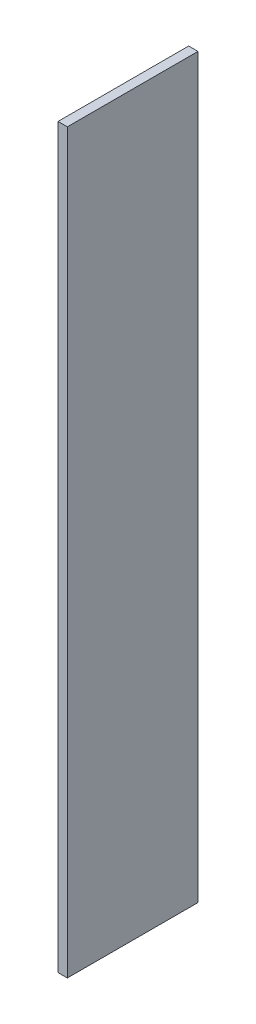
ISO-10303-21;
HEADER;
FILE_DESCRIPTION(('STEP AP214'),'2;1');
FILE_NAME('part.step','',(''),(''),'','','');
FILE_SCHEMA(('AUTOMOTIVE_DESIGN { 1 0 10303 214 1 1 1 1 }'));
ENDSEC;
DATA;
#1=APPLICATION_CONTEXT('core data for automotive mechanical design processes');
#2=APPLICATION_PROTOCOL_DEFINITION('international standard','automotive_design',2000,#1);
#3=PRODUCT_CONTEXT('',#1,'mechanical');
#4=PRODUCT('Part','Part','',(#3));
#5=PRODUCT_RELATED_PRODUCT_CATEGORY('part','',(#4));
#6=PRODUCT_DEFINITION_FORMATION('','',#4);
#7=PRODUCT_DEFINITION_CONTEXT('part definition',#1,'design');
#8=PRODUCT_DEFINITION('design','',#6,#7);
#9=PRODUCT_DEFINITION_SHAPE('','',#8);
#10=(LENGTH_UNIT() NAMED_UNIT(*) SI_UNIT(.MILLI.,.METRE.));
#11=(NAMED_UNIT(*) PLANE_ANGLE_UNIT() SI_UNIT($,.RADIAN.));
#12=(NAMED_UNIT(*) SI_UNIT($,.STERADIAN.) SOLID_ANGLE_UNIT());
#13=UNCERTAINTY_MEASURE_WITH_UNIT(LENGTH_MEASURE(1.E-05),#10,'distance_accuracy_value','');
#14=(GEOMETRIC_REPRESENTATION_CONTEXT(3) GLOBAL_UNCERTAINTY_ASSIGNED_CONTEXT((#13)) GLOBAL_UNIT_ASSIGNED_CONTEXT((#10,
#11,#12)) REPRESENTATION_CONTEXT('',''));
#15=CARTESIAN_POINT('',(0.,0.,0.));
#16=DIRECTION('',(0.,0.,1.));
#17=DIRECTION('',(1.,0.,0.));
#18=AXIS2_PLACEMENT_3D('',#15,#16,#17);
#19=CARTESIAN_POINT('',(6.35,0.,0.));
#20=DIRECTION('',(0.,0.,-1.));
#21=DIRECTION('',(-1.,0.,0.));
#22=AXIS2_PLACEMENT_3D('',#19,#20,#21);
#23=PLANE('',#22);
#24=DIRECTION('',(0.,-1.,0.));
#25=VECTOR('',#24,1.);
#26=CARTESIAN_POINT('',(0.,0.,0.));
#27=LINE('',#26,#25);
#28=CARTESIAN_POINT('',(0.,501.65,0.));
#29=VERTEX_POINT('',#28);
#30=CARTESIAN_POINT('',(0.,0.,0.));
#31=VERTEX_POINT('',#30);
#32=EDGE_CURVE('E95',#29,#31,#27,.T.);
#33=ORIENTED_EDGE('',*,*,#32,.T.);
#34=DIRECTION('',(-1.,0.,0.));
#35=VECTOR('',#34,1.);
#36=CARTESIAN_POINT('',(6.35,0.,0.));
#37=LINE('',#36,#35);
#38=CARTESIAN_POINT('',(6.35,0.,0.));
#39=VERTEX_POINT('',#38);
#40=EDGE_CURVE('E11',#39,#31,#37,.T.);
#41=ORIENTED_EDGE('',*,*,#40,.F.);
#42=DIRECTION('',(0.,-1.,0.));
#43=VECTOR('',#42,1.);
#44=CARTESIAN_POINT('',(6.35,0.,0.));
#45=LINE('',#44,#43);
#46=CARTESIAN_POINT('',(6.35,501.65,0.));
#47=VERTEX_POINT('',#46);
#48=EDGE_CURVE('E83',#47,#39,#45,.T.);
#49=ORIENTED_EDGE('',*,*,#48,.F.);
#50=DIRECTION('',(-1.,0.,0.));
#51=VECTOR('',#50,1.);
#52=CARTESIAN_POINT('',(6.35,501.65,0.));
#53=LINE('',#52,#51);
#54=EDGE_CURVE('E91',#47,#29,#53,.T.);
#55=ORIENTED_EDGE('',*,*,#54,.T.);
#56=EDGE_LOOP('',(#33,#41,#49,#55));
#57=FACE_BOUND('',#56,.T.);
#58=ADVANCED_FACE('F32',(#57),#23,.F.);
#59=CARTESIAN_POINT('',(6.35,0.,0.));
#60=DIRECTION('',(0.,1.,0.));
#61=DIRECTION('',(0.,0.,1.));
#62=AXIS2_PLACEMENT_3D('',#59,#60,#61);
#63=PLANE('',#62);
#64=DIRECTION('',(0.,0.,-1.));
#65=VECTOR('',#64,1.);
#66=CARTESIAN_POINT('',(0.,0.,0.));
#67=LINE('',#66,#65);
#68=CARTESIAN_POINT('',(0.,0.,-88.9));
#69=VERTEX_POINT('',#68);
#70=EDGE_CURVE('E87',#31,#69,#67,.T.);
#71=ORIENTED_EDGE('',*,*,#70,.T.);
#72=DIRECTION('',(-1.,0.,0.));
#73=VECTOR('',#72,1.);
#74=CARTESIAN_POINT('',(6.35,0.,-88.9));
#75=LINE('',#74,#73);
#76=CARTESIAN_POINT('',(6.35,0.,-88.9));
#77=VERTEX_POINT('',#76);
#78=EDGE_CURVE('E40',#77,#69,#75,.T.);
#79=ORIENTED_EDGE('',*,*,#78,.F.);
#80=DIRECTION('',(0.,0.,-1.));
#81=VECTOR('',#80,1.);
#82=CARTESIAN_POINT('',(6.35,0.,0.));
#83=LINE('',#82,#81);
#84=EDGE_CURVE('E78',#39,#77,#83,.T.);
#85=ORIENTED_EDGE('',*,*,#84,.F.);
#86=ORIENTED_EDGE('',*,*,#40,.T.);
#87=EDGE_LOOP('',(#71,#79,#85,#86));
#88=FACE_BOUND('',#87,.T.);
#89=ADVANCED_FACE('F86',(#88),#63,.F.);
#90=CARTESIAN_POINT('',(6.35,0.,-88.9));
#91=DIRECTION('',(0.,0.,1.));
#92=DIRECTION('',(1.,0.,0.));
#93=AXIS2_PLACEMENT_3D('',#90,#91,#92);
#94=PLANE('',#93);
#95=DIRECTION('',(0.,1.,0.));
#96=VECTOR('',#95,1.);
#97=CARTESIAN_POINT('',(0.,0.,-88.9));
#98=LINE('',#97,#96);
#99=CARTESIAN_POINT('',(0.,501.65,-88.9));
#100=VERTEX_POINT('',#99);
#101=EDGE_CURVE('E65',#69,#100,#98,.T.);
#102=ORIENTED_EDGE('',*,*,#101,.T.);
#103=DIRECTION('',(-1.,0.,0.));
#104=VECTOR('',#103,1.);
#105=CARTESIAN_POINT('',(6.35,501.65,-88.9));
#106=LINE('',#105,#104);
#107=CARTESIAN_POINT('',(6.35,501.65,-88.9));
#108=VERTEX_POINT('',#107);
#109=EDGE_CURVE('E88',#108,#100,#106,.T.);
#110=ORIENTED_EDGE('',*,*,#109,.F.);
#111=DIRECTION('',(0.,1.,0.));
#112=VECTOR('',#111,1.);
#113=CARTESIAN_POINT('',(6.35,0.,-88.9));
#114=LINE('',#113,#112);
#115=EDGE_CURVE('E81',#77,#108,#114,.T.);
#116=ORIENTED_EDGE('',*,*,#115,.F.);
#117=ORIENTED_EDGE('',*,*,#78,.T.);
#118=EDGE_LOOP('',(#102,#110,#116,#117));
#119=FACE_BOUND('',#118,.T.);
#120=ADVANCED_FACE('F89',(#119),#94,.F.);
#121=CARTESIAN_POINT('',(6.35,501.65,0.));
#122=DIRECTION('',(0.,-1.,0.));
#123=DIRECTION('',(0.,0.,-1.));
#124=AXIS2_PLACEMENT_3D('',#121,#122,#123);
#125=PLANE('',#124);
#126=DIRECTION('',(0.,0.,1.));
#127=VECTOR('',#126,1.);
#128=CARTESIAN_POINT('',(0.,501.65,0.));
#129=LINE('',#128,#127);
#130=EDGE_CURVE('E71',#100,#29,#129,.T.);
#131=ORIENTED_EDGE('',*,*,#130,.T.);
#132=ORIENTED_EDGE('',*,*,#54,.F.);
#133=DIRECTION('',(0.,0.,1.));
#134=VECTOR('',#133,1.);
#135=CARTESIAN_POINT('',(6.35,501.65,0.));
#136=LINE('',#135,#134);
#137=EDGE_CURVE('E48',#108,#47,#136,.T.);
#138=ORIENTED_EDGE('',*,*,#137,.F.);
#139=ORIENTED_EDGE('',*,*,#109,.T.);
#140=EDGE_LOOP('',(#131,#132,#138,#139));
#141=FACE_BOUND('',#140,.T.);
#142=ADVANCED_FACE('F102',(#141),#125,.F.);
#143=CARTESIAN_POINT('',(6.35,0.,0.));
#144=DIRECTION('',(-1.,0.,0.));
#145=DIRECTION('',(0.,0.,1.));
#146=AXIS2_PLACEMENT_3D('',#143,#144,#145);
#147=PLANE('',#146);
#148=ORIENTED_EDGE('',*,*,#48,.T.);
#149=ORIENTED_EDGE('',*,*,#84,.T.);
#150=ORIENTED_EDGE('',*,*,#115,.T.);
#151=ORIENTED_EDGE('',*,*,#137,.T.);
#152=EDGE_LOOP('',(#148,#149,#150,#151));
#153=FACE_BOUND('',#152,.T.);
#154=ADVANCED_FACE('F79',(#153),#147,.F.);
#155=CARTESIAN_POINT('',(0.,0.,0.));
#156=DIRECTION('',(-1.,0.,0.));
#157=DIRECTION('',(0.,0.,1.));
#158=AXIS2_PLACEMENT_3D('',#155,#156,#157);
#159=PLANE('',#158);
#160=ORIENTED_EDGE('',*,*,#32,.F.);
#161=ORIENTED_EDGE('',*,*,#130,.F.);
#162=ORIENTED_EDGE('',*,*,#101,.F.);
#163=ORIENTED_EDGE('',*,*,#70,.F.);
#164=EDGE_LOOP('',(#160,#161,#162,#163));
#165=FACE_BOUND('',#164,.T.);
#166=ADVANCED_FACE('F105',(#165),#159,.T.);
#167=CLOSED_SHELL('',(#58,#89,#120,#142,#154,#166));
#168=MANIFOLD_SOLID_BREP('B2',#167);
#169=ADVANCED_BREP_SHAPE_REPRESENTATION('',(#18,#168),#14);
#170=SHAPE_DEFINITION_REPRESENTATION(#9,#169);
ENDSEC;
END-ISO-10303-21;
